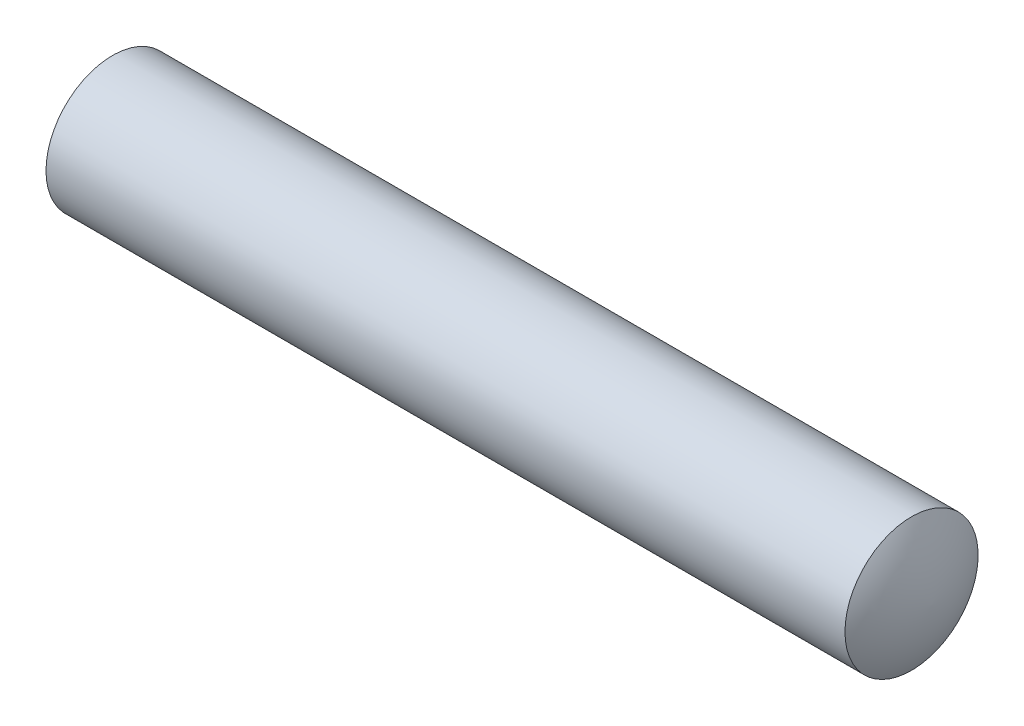
ISO-10303-21;
HEADER;
FILE_DESCRIPTION(('STEP AP214'),'2;1');
FILE_NAME('part.step','',(''),(''),'','','');
FILE_SCHEMA(('AUTOMOTIVE_DESIGN { 1 0 10303 214 1 1 1 1 }'));
ENDSEC;
DATA;
#1=APPLICATION_CONTEXT('core data for automotive mechanical design processes');
#2=APPLICATION_PROTOCOL_DEFINITION('international standard','automotive_design',2000,#1);
#3=PRODUCT_CONTEXT('',#1,'mechanical');
#4=PRODUCT('Part','Part','',(#3));
#5=PRODUCT_RELATED_PRODUCT_CATEGORY('part','',(#4));
#6=PRODUCT_DEFINITION_FORMATION('','',#4);
#7=PRODUCT_DEFINITION_CONTEXT('part definition',#1,'design');
#8=PRODUCT_DEFINITION('design','',#6,#7);
#9=PRODUCT_DEFINITION_SHAPE('','',#8);
#10=(LENGTH_UNIT() NAMED_UNIT(*) SI_UNIT(.MILLI.,.METRE.));
#11=(NAMED_UNIT(*) PLANE_ANGLE_UNIT() SI_UNIT($,.RADIAN.));
#12=(NAMED_UNIT(*) SI_UNIT($,.STERADIAN.) SOLID_ANGLE_UNIT());
#13=UNCERTAINTY_MEASURE_WITH_UNIT(LENGTH_MEASURE(1.E-05),#10,'distance_accuracy_value','');
#14=(GEOMETRIC_REPRESENTATION_CONTEXT(3) GLOBAL_UNCERTAINTY_ASSIGNED_CONTEXT((#13)) GLOBAL_UNIT_ASSIGNED_CONTEXT((#10,
#11,#12)) REPRESENTATION_CONTEXT('',''));
#15=CARTESIAN_POINT('',(0.,0.,0.));
#16=DIRECTION('',(0.,0.,1.));
#17=DIRECTION('',(1.,0.,0.));
#18=AXIS2_PLACEMENT_3D('',#15,#16,#17);
#19=CARTESIAN_POINT('',(3.39849957179514,0.,-0.109549871538541));
#20=DIRECTION('',(0.,-1.,0.));
#21=DIRECTION('',(0.,0.,1.));
#22=AXIS2_PLACEMENT_3D('',#19,#20,#21);
#23=CIRCLE('',#22,4.);
#24=TRIMMED_CURVE('',#23,(PARAMETER_VALUE(-1.5434054339856)),(PARAMETER_VALUE(1.5434054339856)),
.T.,.PARAMETER.);
#25=CARTESIAN_POINT('',(3.39849957179514,0.,0.));
#26=DIRECTION('',(-1.,0.,0.));
#27=AXIS1_PLACEMENT('',#25,#26);
#28=SURFACE_OF_REVOLUTION('',#24,#27);
#29=CARTESIAN_POINT('',(-0.6,0.,0.));
#30=VERTEX_POINT('',#29);
#31=VERTEX_LOOP('',#30);
#32=FACE_BOUND('',#31,.T.);
#33=CARTESIAN_POINT('',(0.,0.,0.));
#34=DIRECTION('',(-1.,0.,0.));
#35=DIRECTION('',(0.,0.,1.));
#36=AXIS2_PLACEMENT_3D('',#33,#34,#35);
#37=CIRCLE('',#36,2.);
#38=CARTESIAN_POINT('',(0.,0.,2.));
#39=VERTEX_POINT('',#38);
#40=EDGE_CURVE('E44',#39,#39,#37,.T.);
#41=ORIENTED_EDGE('',*,*,#40,.T.);
#42=EDGE_LOOP('',(#41));
#43=FACE_BOUND('',#42,.T.);
#44=ADVANCED_FACE('F37',(#32,#43),#28,.T.);
#45=CARTESIAN_POINT('',(20.6015004282049,0.,-0.109549871538546));
#46=DIRECTION('',(0.,-1.,0.));
#47=DIRECTION('',(0.,0.,1.));
#48=AXIS2_PLACEMENT_3D('',#45,#46,#47);
#49=CIRCLE('',#48,4.);
#50=TRIMMED_CURVE('',#49,(PARAMETER_VALUE(-1.5434054339856)),(PARAMETER_VALUE(1.5434054339856)),
.T.,.PARAMETER.);
#51=CARTESIAN_POINT('',(20.6015004282049,0.,0.));
#52=DIRECTION('',(-1.,0.,0.));
#53=AXIS1_PLACEMENT('',#51,#52);
#54=SURFACE_OF_REVOLUTION('',#50,#53);
#55=CARTESIAN_POINT('',(24.,0.,0.));
#56=DIRECTION('',(-1.,0.,0.));
#57=DIRECTION('',(0.,0.,1.));
#58=AXIS2_PLACEMENT_3D('',#55,#56,#57);
#59=CIRCLE('',#58,2.);
#60=CARTESIAN_POINT('',(24.,0.,2.));
#61=VERTEX_POINT('',#60);
#62=EDGE_CURVE('E11',#61,#61,#59,.T.);
#63=ORIENTED_EDGE('',*,*,#62,.F.);
#64=EDGE_LOOP('',(#63));
#65=FACE_BOUND('',#64,.T.);
#66=CARTESIAN_POINT('',(24.6,0.,0.));
#67=VERTEX_POINT('',#66);
#68=VERTEX_LOOP('',#67);
#69=FACE_BOUND('',#68,.T.);
#70=ADVANCED_FACE('F52',(#65,#69),#54,.T.);
#71=CARTESIAN_POINT('',(0.,0.,0.));
#72=DIRECTION('',(-1.,0.,0.));
#73=DIRECTION('',(0.,0.,1.));
#74=AXIS2_PLACEMENT_3D('',#71,#72,#73);
#75=CYLINDRICAL_SURFACE('',#74,2.);
#76=ORIENTED_EDGE('',*,*,#40,.F.);
#77=EDGE_LOOP('',(#76));
#78=FACE_BOUND('',#77,.T.);
#79=ORIENTED_EDGE('',*,*,#62,.T.);
#80=EDGE_LOOP('',(#79));
#81=FACE_BOUND('',#80,.T.);
#82=ADVANCED_FACE('F56',(#78,#81),#75,.T.);
#83=CLOSED_SHELL('',(#44,#70,#82));
#84=MANIFOLD_SOLID_BREP('B2',#83);
#85=ADVANCED_BREP_SHAPE_REPRESENTATION('',(#18,#84),#14);
#86=SHAPE_DEFINITION_REPRESENTATION(#9,#85);
ENDSEC;
END-ISO-10303-21;
